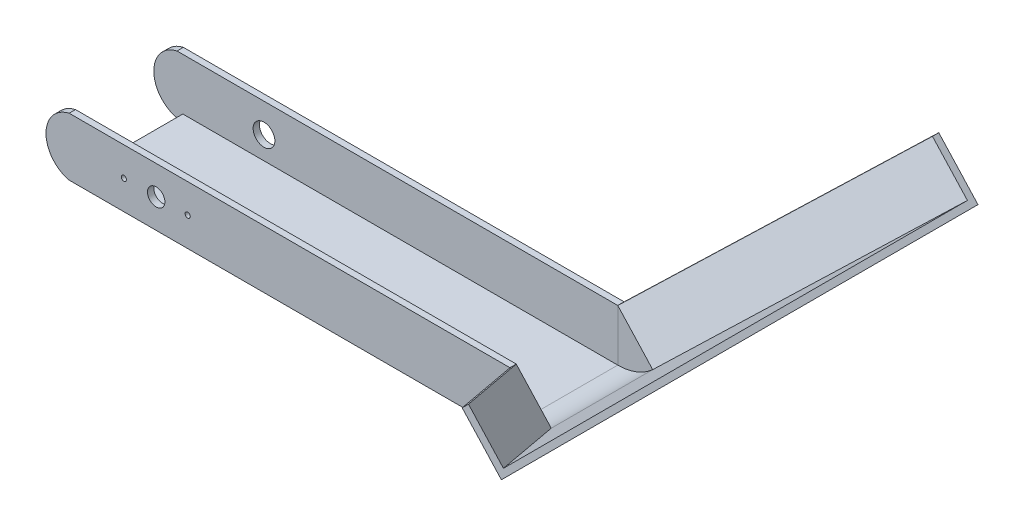
ISO-10303-21;
HEADER;
FILE_DESCRIPTION(('STEP AP214'),'2;1');
FILE_NAME('part.step','',(''),(''),'','','');
FILE_SCHEMA(('AUTOMOTIVE_DESIGN { 1 0 10303 214 1 1 1 1 }'));
ENDSEC;
DATA;
#1=APPLICATION_CONTEXT('core data for automotive mechanical design processes');
#2=APPLICATION_PROTOCOL_DEFINITION('international standard','automotive_design',2000,#1);
#3=PRODUCT_CONTEXT('',#1,'mechanical');
#4=PRODUCT('Part','Part','',(#3));
#5=PRODUCT_RELATED_PRODUCT_CATEGORY('part','',(#4));
#6=PRODUCT_DEFINITION_FORMATION('','',#4);
#7=PRODUCT_DEFINITION_CONTEXT('part definition',#1,'design');
#8=PRODUCT_DEFINITION('design','',#6,#7);
#9=PRODUCT_DEFINITION_SHAPE('','',#8);
#10=(LENGTH_UNIT() NAMED_UNIT(*) SI_UNIT(.MILLI.,.METRE.));
#11=(NAMED_UNIT(*) PLANE_ANGLE_UNIT() SI_UNIT($,.RADIAN.));
#12=(NAMED_UNIT(*) SI_UNIT($,.STERADIAN.) SOLID_ANGLE_UNIT());
#13=UNCERTAINTY_MEASURE_WITH_UNIT(LENGTH_MEASURE(1.E-05),#10,'distance_accuracy_value','');
#14=(GEOMETRIC_REPRESENTATION_CONTEXT(3) GLOBAL_UNCERTAINTY_ASSIGNED_CONTEXT((#13)) GLOBAL_UNIT_ASSIGNED_CONTEXT((#10,
#11,#12)) REPRESENTATION_CONTEXT('',''));
#15=CARTESIAN_POINT('',(0.,0.,0.));
#16=DIRECTION('',(0.,0.,1.));
#17=DIRECTION('',(1.,0.,0.));
#18=AXIS2_PLACEMENT_3D('',#15,#16,#17);
#19=CARTESIAN_POINT('',(-90.1530320109,-16.1412270673509,31.4271677660097));
#20=DIRECTION('',(0.,0.,-1.));
#21=DIRECTION('',(-1.,0.,0.));
#22=AXIS2_PLACEMENT_3D('',#19,#20,#21);
#23=PLANE('',#22);
#24=CARTESIAN_POINT('',(-41.1178794585354,-16.1412265646858,31.4271677660097));
#25=DIRECTION('',(0.,0.,1.));
#26=DIRECTION('',(1.,0.,0.));
#27=AXIS2_PLACEMENT_3D('',#24,#25,#26);
#28=CIRCLE('',#27,1.13029999999999);
#29=CARTESIAN_POINT('',(-39.9875794585354,-16.1412265646858,31.4271677660097));
#30=VERTEX_POINT('',#29);
#31=EDGE_CURVE('P0_E174',#30,#30,#28,.T.);
#32=ORIENTED_EDGE('',*,*,#31,.F.);
#33=EDGE_LOOP('',(#32));
#34=FACE_BOUND('',#33,.T.);
#35=CARTESIAN_POINT('',(-69.0781994585354,-16.1412265646858,31.4271677660097));
#36=DIRECTION('',(0.,0.,1.));
#37=DIRECTION('',(1.,0.,0.));
#38=AXIS2_PLACEMENT_3D('',#35,#36,#37);
#39=CIRCLE('',#38,1.13029999999999);
#40=CARTESIAN_POINT('',(-67.9478994585354,-16.1412265646858,31.4271677660097));
#41=VERTEX_POINT('',#40);
#42=EDGE_CURVE('P0_E168',#41,#41,#39,.T.);
#43=ORIENTED_EDGE('',*,*,#42,.F.);
#44=EDGE_LOOP('',(#43));
#45=FACE_BOUND('',#44,.T.);
#46=CARTESIAN_POINT('',(-90.1530320109,-16.1412270673509,31.4271677660097));
#47=DIRECTION('',(0.,0.,-1.));
#48=DIRECTION('',(-1.,0.,0.));
#49=AXIS2_PLACEMENT_3D('',#46,#47,#48);
#50=CIRCLE('',#49,13.0175001379264);
#51=CARTESIAN_POINT('',(-93.0105326392311,-28.8412270673509,31.4271677660097));
#52=VERTEX_POINT('',#51);
#53=CARTESIAN_POINT('',(-93.0105326392311,-3.44122706735089,31.4271677660097));
#54=VERTEX_POINT('',#53);
#55=EDGE_CURVE('P0_E86',#52,#54,#50,.T.);
#56=ORIENTED_EDGE('',*,*,#55,.F.);
#57=DIRECTION('',(-1.,0.,0.));
#58=VECTOR('',#57,1.);
#59=CARTESIAN_POINT('',(100.029467360769,-28.8412270673509,31.4271677660097));
#60=LINE('',#59,#58);
#61=CARTESIAN_POINT('',(100.029467360769,-28.8412270673509,31.4271677660097));
#62=VERTEX_POINT('',#61);
#63=EDGE_CURVE('P0_E71',#62,#52,#60,.T.);
#64=ORIENTED_EDGE('',*,*,#63,.F.);
#65=DIRECTION('',(0.,-1.,0.));
#66=VECTOR('',#65,1.);
#67=CARTESIAN_POINT('',(100.029467360769,-28.8412270673509,31.4271677660097));
#68=LINE('',#67,#66);
#69=CARTESIAN_POINT('',(100.029467360769,-3.44122706735089,31.4271677660097));
#70=VERTEX_POINT('',#69);
#71=EDGE_CURVE('P0_E59',#70,#62,#68,.T.);
#72=ORIENTED_EDGE('',*,*,#71,.F.);
#73=DIRECTION('',(-1.,0.,0.));
#74=VECTOR('',#73,1.);
#75=CARTESIAN_POINT('',(100.029467360769,-3.44122706735089,31.4271677660097));
#76=LINE('',#75,#74);
#77=EDGE_CURVE('P0_E81',#70,#54,#76,.T.);
#78=ORIENTED_EDGE('',*,*,#77,.T.);
#79=EDGE_LOOP('',(#56,#64,#72,#78));
#80=FACE_BOUND('',#79,.T.);
#81=CARTESIAN_POINT('',(-54.9105326392313,-16.1412265646858,31.4271677660097));
#82=DIRECTION('',(0.,0.,1.));
#83=DIRECTION('',(1.,0.,0.));
#84=AXIS2_PLACEMENT_3D('',#81,#82,#83);
#85=CIRCLE('',#84,3.81000000000001);
#86=CARTESIAN_POINT('',(-51.1005326392313,-16.1412265646858,31.4271677660097));
#87=VERTEX_POINT('',#86);
#88=EDGE_CURVE('P0_E177',#87,#87,#85,.T.);
#89=ORIENTED_EDGE('',*,*,#88,.F.);
#90=EDGE_LOOP('',(#89));
#91=FACE_BOUND('',#90,.T.);
#92=ADVANCED_FACE('P0_F33',(#34,#45,#80,#91),#23,.F.);
#93=CARTESIAN_POINT('',(0.,-26.0726270673509,0.));
#94=DIRECTION('',(0.,1.,0.));
#95=DIRECTION('',(0.,0.,1.));
#96=AXIS2_PLACEMENT_3D('',#93,#94,#95);
#97=PLANE('',#96);
#98=DIRECTION('',(-1.,0.,0.));
#99=VECTOR('',#98,1.);
#100=CARTESIAN_POINT('',(100.029467360769,-26.0726270673509,-15.7914322339903));
#101=LINE('',#100,#99);
#102=CARTESIAN_POINT('',(100.029467360769,-26.0726270673509,-15.7914322339903));
#103=VERTEX_POINT('',#102);
#104=CARTESIAN_POINT('',(-90.4705326392311,-26.0726270673509,-15.7914322339903));
#105=VERTEX_POINT('',#104);
#106=EDGE_CURVE('P0_E103',#103,#105,#101,.T.);
#107=ORIENTED_EDGE('',*,*,#106,.T.);
#108=DIRECTION('',(0.,0.,-1.));
#109=VECTOR('',#108,1.);
#110=CARTESIAN_POINT('',(-90.4705326392311,-26.0726270673509,28.6585677660097));
#111=LINE('',#110,#109);
#112=CARTESIAN_POINT('',(-90.4705326392311,-26.0726270673509,28.6585677660097));
#113=VERTEX_POINT('',#112);
#114=EDGE_CURVE('P0_E121',#113,#105,#111,.T.);
#115=ORIENTED_EDGE('',*,*,#114,.F.);
#116=DIRECTION('',(1.,0.,0.));
#117=VECTOR('',#116,1.);
#118=CARTESIAN_POINT('',(-93.0105326392311,-26.0726270673509,28.6585677660097));
#119=LINE('',#118,#117);
#120=CARTESIAN_POINT('',(100.029467360769,-26.0726270673509,28.6585677660097));
#121=VERTEX_POINT('',#120);
#122=EDGE_CURVE('P0_E107',#113,#121,#119,.T.);
#123=ORIENTED_EDGE('',*,*,#122,.T.);
#124=DIRECTION('',(0.,0.,-1.));
#125=VECTOR('',#124,1.);
#126=CARTESIAN_POINT('',(100.029467360769,-26.0726270673509,28.6585677660097));
#127=LINE('',#126,#125);
#128=EDGE_CURVE('P0_E111',#121,#103,#127,.T.);
#129=ORIENTED_EDGE('',*,*,#128,.T.);
#130=EDGE_LOOP('',(#107,#115,#123,#129));
#131=FACE_BOUND('',#130,.T.);
#132=ADVANCED_FACE('P0_F224',(#131),#97,.T.);
#133=CARTESIAN_POINT('',(-90.1530320109,-16.1412270673509,31.4271677660097));
#134=DIRECTION('',(0.,0.,-1.));
#135=DIRECTION('',(-1.,0.,0.));
#136=AXIS2_PLACEMENT_3D('',#133,#134,#135);
#137=CYLINDRICAL_SURFACE('',#136,13.0175001379264);
#138=CARTESIAN_POINT('',(-90.1530320109,-16.1412270673509,28.6585677660097));
#139=DIRECTION('',(0.,0.,-1.));
#140=DIRECTION('',(-1.,0.,0.));
#141=AXIS2_PLACEMENT_3D('',#138,#139,#140);
#142=CIRCLE('',#141,13.0175001379264);
#143=CARTESIAN_POINT('',(-93.0105326392311,-28.8412270673509,28.6585677660097));
#144=VERTEX_POINT('',#143);
#145=CARTESIAN_POINT('',(-93.0105326392311,-3.44122706735089,28.6585677660097));
#146=VERTEX_POINT('',#145);
#147=EDGE_CURVE('P0_E88',#144,#146,#142,.T.);
#148=ORIENTED_EDGE('',*,*,#147,.F.);
#149=DIRECTION('',(0.,0.,-1.));
#150=VECTOR('',#149,1.);
#151=CARTESIAN_POINT('',(-93.0105326392311,-28.8412270673509,31.4271677660097));
#152=LINE('',#151,#150);
#153=EDGE_CURVE('P0_E11',#52,#144,#152,.T.);
#154=ORIENTED_EDGE('',*,*,#153,.F.);
#155=ORIENTED_EDGE('',*,*,#55,.T.);
#156=DIRECTION('',(0.,0.,-1.));
#157=VECTOR('',#156,1.);
#158=CARTESIAN_POINT('',(-93.0105326392311,-3.44122706735089,31.4271677660097));
#159=LINE('',#158,#157);
#160=EDGE_CURVE('P0_E42',#54,#146,#159,.T.);
#161=ORIENTED_EDGE('',*,*,#160,.T.);
#162=EDGE_LOOP('',(#148,#154,#155,#161));
#163=FACE_BOUND('',#162,.T.);
#164=ADVANCED_FACE('P0_F35',(#163),#137,.T.);
#165=CARTESIAN_POINT('',(-90.1530320109,-16.1412270673509,28.6585677660097));
#166=DIRECTION('',(0.,0.,-1.));
#167=DIRECTION('',(-1.,0.,0.));
#168=AXIS2_PLACEMENT_3D('',#165,#166,#167);
#169=PLANE('',#168);
#170=CARTESIAN_POINT('',(-54.9105326392313,-16.1412265646858,28.6585677660097));
#171=DIRECTION('',(0.,0.,-1.));
#172=DIRECTION('',(-1.,0.,0.));
#173=AXIS2_PLACEMENT_3D('',#170,#171,#172);
#174=CIRCLE('',#173,3.81000000000001);
#175=CARTESIAN_POINT('',(-58.7205326392314,-16.1412265646858,28.6585677660097));
#176=VERTEX_POINT('',#175);
#177=EDGE_CURVE('P0_E37',#176,#176,#174,.T.);
#178=ORIENTED_EDGE('',*,*,#177,.F.);
#179=EDGE_LOOP('',(#178));
#180=FACE_BOUND('',#179,.T.);
#181=CARTESIAN_POINT('',(-41.1178794585354,-16.1412265646858,28.6585677660097));
#182=DIRECTION('',(0.,0.,-1.));
#183=DIRECTION('',(-1.,0.,0.));
#184=AXIS2_PLACEMENT_3D('',#181,#182,#183);
#185=CIRCLE('',#184,1.13029999999999);
#186=CARTESIAN_POINT('',(-42.2481794585354,-16.1412265646858,28.6585677660097));
#187=VERTEX_POINT('',#186);
#188=EDGE_CURVE('P0_E171',#187,#187,#185,.T.);
#189=ORIENTED_EDGE('',*,*,#188,.F.);
#190=EDGE_LOOP('',(#189));
#191=FACE_BOUND('',#190,.T.);
#192=CARTESIAN_POINT('',(-69.0781994585354,-16.1412265646858,28.6585677660097));
#193=DIRECTION('',(0.,0.,-1.));
#194=DIRECTION('',(-1.,0.,0.));
#195=AXIS2_PLACEMENT_3D('',#192,#193,#194);
#196=CIRCLE('',#195,1.13029999999999);
#197=CARTESIAN_POINT('',(-70.2084994585354,-16.1412265646858,28.6585677660097));
#198=VERTEX_POINT('',#197);
#199=EDGE_CURVE('P0_E165',#198,#198,#196,.T.);
#200=ORIENTED_EDGE('',*,*,#199,.F.);
#201=EDGE_LOOP('',(#200));
#202=FACE_BOUND('',#201,.T.);
#203=DIRECTION('',(-1.,0.,0.));
#204=VECTOR('',#203,1.);
#205=CARTESIAN_POINT('',(-90.4705326392311,-28.8412270673509,28.6585677660097));
#206=LINE('',#205,#204);
#207=CARTESIAN_POINT('',(-90.4705326392311,-28.8412270673509,28.6585677660097));
#208=VERTEX_POINT('',#207);
#209=EDGE_CURVE('P0_E108',#208,#144,#206,.T.);
#210=ORIENTED_EDGE('',*,*,#209,.T.);
#211=ORIENTED_EDGE('',*,*,#147,.T.);
#212=DIRECTION('',(1.,0.,0.));
#213=VECTOR('',#212,1.);
#214=CARTESIAN_POINT('',(-93.0105326392311,-3.44122706735089,28.6585677660097));
#215=LINE('',#214,#213);
#216=CARTESIAN_POINT('',(100.029467360769,-3.44122706735089,28.6585677660097));
#217=VERTEX_POINT('',#216);
#218=EDGE_CURVE('P0_E104',#146,#217,#215,.T.);
#219=ORIENTED_EDGE('',*,*,#218,.T.);
#220=DIRECTION('',(0.,1.,0.));
#221=VECTOR('',#220,1.);
#222=CARTESIAN_POINT('',(100.029467360769,-26.0726270673509,28.6585677660097));
#223=LINE('',#222,#221);
#224=EDGE_CURVE('P0_E100',#121,#217,#223,.T.);
#225=ORIENTED_EDGE('',*,*,#224,.F.);
#226=ORIENTED_EDGE('',*,*,#122,.F.);
#227=DIRECTION('',(0.,1.,0.));
#228=VECTOR('',#227,1.);
#229=CARTESIAN_POINT('',(-90.4705326392311,-28.8412270673509,28.6585677660097));
#230=LINE('',#229,#228);
#231=EDGE_CURVE('P0_E50',#208,#113,#230,.T.);
#232=ORIENTED_EDGE('',*,*,#231,.F.);
#233=EDGE_LOOP('',(#210,#211,#219,#225,#226,#232));
#234=FACE_BOUND('',#233,.T.);
#235=ADVANCED_FACE('P0_F186',(#180,#191,#202,#234),#169,.T.);
#236=CARTESIAN_POINT('',(100.029467360769,-3.44122706735089,31.4271677660097));
#237=DIRECTION('',(0.,-1.,0.));
#238=DIRECTION('',(0.,0.,-1.));
#239=AXIS2_PLACEMENT_3D('',#236,#237,#238);
#240=PLANE('',#239);
#241=DIRECTION('',(0.,0.,1.));
#242=VECTOR('',#241,1.);
#243=CARTESIAN_POINT('',(100.029467360769,-3.44122706735089,31.4271677660097));
#244=LINE('',#243,#242);
#245=EDGE_CURVE('P0_E98',#217,#70,#244,.T.);
#246=ORIENTED_EDGE('',*,*,#245,.F.);
#247=ORIENTED_EDGE('',*,*,#218,.F.);
#248=ORIENTED_EDGE('',*,*,#160,.F.);
#249=ORIENTED_EDGE('',*,*,#77,.F.);
#250=EDGE_LOOP('',(#246,#247,#248,#249));
#251=FACE_BOUND('',#250,.T.);
#252=ADVANCED_FACE('P0_F189',(#251),#240,.F.);
#253=CARTESIAN_POINT('',(100.029467360769,-28.8412270673509,-15.7914322339903));
#254=DIRECTION('',(0.,1.,0.));
#255=DIRECTION('',(0.,0.,1.));
#256=AXIS2_PLACEMENT_3D('',#253,#254,#255);
#257=PLANE('',#256);
#258=ORIENTED_EDGE('',*,*,#153,.T.);
#259=ORIENTED_EDGE('',*,*,#209,.F.);
#260=DIRECTION('',(0.,0.,1.));
#261=VECTOR('',#260,1.);
#262=CARTESIAN_POINT('',(-90.4705326392311,-28.8412270673509,-15.7914322339903));
#263=LINE('',#262,#261);
#264=CARTESIAN_POINT('',(-90.4705326392311,-28.8412270673509,-15.7914322339903));
#265=VERTEX_POINT('',#264);
#266=EDGE_CURVE('P0_E124',#265,#208,#263,.T.);
#267=ORIENTED_EDGE('',*,*,#266,.F.);
#268=DIRECTION('',(-1.,0.,0.));
#269=VECTOR('',#268,1.);
#270=CARTESIAN_POINT('',(-93.0105326392311,-28.8412270673509,-15.7914322339903));
#271=LINE('',#270,#269);
#272=CARTESIAN_POINT('',(-93.0105326392311,-28.8412270673509,-15.7914322339903));
#273=VERTEX_POINT('',#272);
#274=EDGE_CURVE('P0_E146',#265,#273,#271,.T.);
#275=ORIENTED_EDGE('',*,*,#274,.T.);
#276=DIRECTION('',(0.,0.,1.));
#277=VECTOR('',#276,1.);
#278=CARTESIAN_POINT('',(-93.0105326392311,-28.8412270673509,-18.5600322339903));
#279=LINE('',#278,#277);
#280=CARTESIAN_POINT('',(-93.0105326392311,-28.8412270673509,-18.5600322339903));
#281=VERTEX_POINT('',#280);
#282=EDGE_CURVE('P0_E126',#281,#273,#279,.T.);
#283=ORIENTED_EDGE('',*,*,#282,.F.);
#284=DIRECTION('',(-1.,0.,0.));
#285=VECTOR('',#284,1.);
#286=CARTESIAN_POINT('',(-93.0105326392311,-28.8412270673509,-18.5600322339903));
#287=LINE('',#286,#285);
#288=CARTESIAN_POINT('',(100.029467360769,-28.8412270673509,-18.5600322339903));
#289=VERTEX_POINT('',#288);
#290=EDGE_CURVE('P0_E139',#289,#281,#287,.T.);
#291=ORIENTED_EDGE('',*,*,#290,.F.);
#292=DIRECTION('',(0.,0.,-1.));
#293=VECTOR('',#292,1.);
#294=CARTESIAN_POINT('',(100.029467360769,-28.8412270673509,-15.7914322339903));
#295=LINE('',#294,#293);
#296=EDGE_CURVE('P0_E78',#62,#289,#295,.T.);
#297=ORIENTED_EDGE('',*,*,#296,.F.);
#298=ORIENTED_EDGE('',*,*,#63,.T.);
#299=EDGE_LOOP('',(#258,#259,#267,#275,#283,#291,#297,#298));
#300=FACE_BOUND('',#299,.T.);
#301=ADVANCED_FACE('P0_F73',(#300),#257,.F.);
#302=CARTESIAN_POINT('',(100.029467360769,0.,0.));
#303=DIRECTION('',(-1.,0.,0.));
#304=DIRECTION('',(0.,0.,1.));
#305=AXIS2_PLACEMENT_3D('',#302,#303,#304);
#306=PLANE('',#305);
#307=ORIENTED_EDGE('',*,*,#128,.F.);
#308=ORIENTED_EDGE('',*,*,#224,.T.);
#309=ORIENTED_EDGE('',*,*,#245,.T.);
#310=ORIENTED_EDGE('',*,*,#71,.T.);
#311=ORIENTED_EDGE('',*,*,#296,.T.);
#312=DIRECTION('',(0.,-1.,0.));
#313=VECTOR('',#312,1.);
#314=CARTESIAN_POINT('',(100.029467360769,-28.8412270673509,-18.5600322339903));
#315=LINE('',#314,#313);
#316=CARTESIAN_POINT('',(100.029467360769,-3.44122706735089,-18.5600322339903));
#317=VERTEX_POINT('',#316);
#318=EDGE_CURVE('P0_E135',#317,#289,#315,.T.);
#319=ORIENTED_EDGE('',*,*,#318,.F.);
#320=DIRECTION('',(0.,0.,1.));
#321=VECTOR('',#320,1.);
#322=CARTESIAN_POINT('',(100.029467360769,-3.44122706735089,-18.5600322339903));
#323=LINE('',#322,#321);
#324=CARTESIAN_POINT('',(100.029467360769,-3.44122706735089,-15.7914322339903));
#325=VERTEX_POINT('',#324);
#326=EDGE_CURVE('P0_E132',#317,#325,#323,.T.);
#327=ORIENTED_EDGE('',*,*,#326,.T.);
#328=DIRECTION('',(0.,-1.,0.));
#329=VECTOR('',#328,1.);
#330=CARTESIAN_POINT('',(100.029467360769,-28.8412270673509,-15.7914322339903));
#331=LINE('',#330,#329);
#332=EDGE_CURVE('P0_E136',#325,#103,#331,.T.);
#333=ORIENTED_EDGE('',*,*,#332,.T.);
#334=EDGE_LOOP('',(#307,#308,#309,#310,#311,#319,#327,#333));
#335=FACE_BOUND('',#334,.T.);
#336=ADVANCED_FACE('P0_F215',(#335),#306,.F.);
#337=CARTESIAN_POINT('',(-90.4705326392311,0.,0.));
#338=DIRECTION('',(-1.,0.,0.));
#339=DIRECTION('',(0.,0.,1.));
#340=AXIS2_PLACEMENT_3D('',#337,#338,#339);
#341=PLANE('',#340);
#342=ORIENTED_EDGE('',*,*,#266,.T.);
#343=ORIENTED_EDGE('',*,*,#231,.T.);
#344=ORIENTED_EDGE('',*,*,#114,.T.);
#345=DIRECTION('',(0.,-1.,0.));
#346=VECTOR('',#345,1.);
#347=CARTESIAN_POINT('',(-90.4705326392311,-26.0726270673509,-15.7914322339903));
#348=LINE('',#347,#346);
#349=EDGE_CURVE('P0_E118',#105,#265,#348,.T.);
#350=ORIENTED_EDGE('',*,*,#349,.T.);
#351=EDGE_LOOP('',(#342,#343,#344,#350));
#352=FACE_BOUND('',#351,.T.);
#353=ADVANCED_FACE('P0_F260',(#352),#341,.T.);
#354=CARTESIAN_POINT('',(-90.1530320109,-16.1412265646858,-15.7914322339903));
#355=DIRECTION('',(0.,0.,1.));
#356=DIRECTION('',(1.,0.,0.));
#357=AXIS2_PLACEMENT_3D('',#354,#355,#356);
#358=PLANE('',#357);
#359=CARTESIAN_POINT('',(-54.9105326392313,-16.1412265646858,-15.7914322339903));
#360=DIRECTION('',(0.,0.,1.));
#361=DIRECTION('',(1.,0.,0.));
#362=AXIS2_PLACEMENT_3D('',#359,#360,#361);
#363=CIRCLE('',#362,4.76249999999998);
#364=CARTESIAN_POINT('',(-50.1480326392314,-16.1412265646858,-15.7914322339903));
#365=VERTEX_POINT('',#364);
#366=EDGE_CURVE('P0_E162',#365,#365,#363,.T.);
#367=ORIENTED_EDGE('',*,*,#366,.F.);
#368=EDGE_LOOP('',(#367));
#369=FACE_BOUND('',#368,.T.);
#370=ORIENTED_EDGE('',*,*,#349,.F.);
#371=ORIENTED_EDGE('',*,*,#106,.F.);
#372=ORIENTED_EDGE('',*,*,#332,.F.);
#373=DIRECTION('',(1.,0.,0.));
#374=VECTOR('',#373,1.);
#375=CARTESIAN_POINT('',(100.029467360769,-3.44122706735089,-15.7914322339903));
#376=LINE('',#375,#374);
#377=CARTESIAN_POINT('',(-93.0105371073609,-3.44122706735089,-15.7914322339903));
#378=VERTEX_POINT('',#377);
#379=EDGE_CURVE('P0_E140',#378,#325,#376,.T.);
#380=ORIENTED_EDGE('',*,*,#379,.F.);
#381=CARTESIAN_POINT('',(-90.1530320109,-16.1412265646858,-15.7914322339903));
#382=DIRECTION('',(0.,0.,-1.));
#383=DIRECTION('',(1.,0.,0.));
#384=AXIS2_PLACEMENT_3D('',#381,#382,#383);
#385=CIRCLE('',#384,13.0175006283313);
#386=EDGE_CURVE('P0_E143',#273,#378,#385,.T.);
#387=ORIENTED_EDGE('',*,*,#386,.F.);
#388=ORIENTED_EDGE('',*,*,#274,.F.);
#389=EDGE_LOOP('',(#370,#371,#372,#380,#387,#388));
#390=FACE_BOUND('',#389,.T.);
#391=ADVANCED_FACE('P0_F256',(#369,#390),#358,.T.);
#392=CARTESIAN_POINT('',(-90.1530320109,-16.1412265646858,-18.5600322339903));
#393=DIRECTION('',(0.,0.,1.));
#394=DIRECTION('',(1.,0.,0.));
#395=AXIS2_PLACEMENT_3D('',#392,#393,#394);
#396=CYLINDRICAL_SURFACE('',#395,13.0175006283313);
#397=ORIENTED_EDGE('',*,*,#386,.T.);
#398=DIRECTION('',(0.,0.,1.));
#399=VECTOR('',#398,1.);
#400=CARTESIAN_POINT('',(-93.0105371073609,-3.44122706735089,-18.5600322339903));
#401=LINE('',#400,#399);
#402=CARTESIAN_POINT('',(-93.0105371073609,-3.44122706735089,-18.5600322339903));
#403=VERTEX_POINT('',#402);
#404=EDGE_CURVE('P0_E129',#403,#378,#401,.T.);
#405=ORIENTED_EDGE('',*,*,#404,.F.);
#406=CARTESIAN_POINT('',(-90.1530320109,-16.1412265646858,-18.5600322339903));
#407=DIRECTION('',(0.,0.,-1.));
#408=DIRECTION('',(1.,0.,0.));
#409=AXIS2_PLACEMENT_3D('',#406,#407,#408);
#410=CIRCLE('',#409,13.0175006283313);
#411=EDGE_CURVE('P0_E155',#281,#403,#410,.T.);
#412=ORIENTED_EDGE('',*,*,#411,.F.);
#413=ORIENTED_EDGE('',*,*,#282,.T.);
#414=EDGE_LOOP('',(#397,#405,#412,#413));
#415=FACE_BOUND('',#414,.T.);
#416=ADVANCED_FACE('P0_F259',(#415),#396,.T.);
#417=CARTESIAN_POINT('',(100.029467360769,-3.44122706735089,-18.5600322339903));
#418=DIRECTION('',(0.,-1.,0.));
#419=DIRECTION('',(0.,0.,-1.));
#420=AXIS2_PLACEMENT_3D('',#417,#418,#419);
#421=PLANE('',#420);
#422=ORIENTED_EDGE('',*,*,#379,.T.);
#423=ORIENTED_EDGE('',*,*,#326,.F.);
#424=DIRECTION('',(1.,0.,0.));
#425=VECTOR('',#424,1.);
#426=CARTESIAN_POINT('',(100.029467360769,-3.44122706735089,-18.5600322339903));
#427=LINE('',#426,#425);
#428=EDGE_CURVE('P0_E152',#403,#317,#427,.T.);
#429=ORIENTED_EDGE('',*,*,#428,.F.);
#430=ORIENTED_EDGE('',*,*,#404,.T.);
#431=EDGE_LOOP('',(#422,#423,#429,#430));
#432=FACE_BOUND('',#431,.T.);
#433=ADVANCED_FACE('P0_F254',(#432),#421,.F.);
#434=CARTESIAN_POINT('',(-90.1530320109,-16.1412265646858,-18.5600322339903));
#435=DIRECTION('',(0.,0.,1.));
#436=DIRECTION('',(1.,0.,0.));
#437=AXIS2_PLACEMENT_3D('',#434,#435,#436);
#438=PLANE('',#437);
#439=CARTESIAN_POINT('',(-54.9105326392313,-16.1412265646858,-18.5600322339903));
#440=DIRECTION('',(0.,0.,1.));
#441=DIRECTION('',(1.,0.,0.));
#442=AXIS2_PLACEMENT_3D('',#439,#440,#441);
#443=CIRCLE('',#442,4.76249999999998);
#444=CARTESIAN_POINT('',(-50.1480326392314,-16.1412265646858,-18.5600322339903));
#445=VERTEX_POINT('',#444);
#446=EDGE_CURVE('P0_E149',#445,#445,#443,.T.);
#447=ORIENTED_EDGE('',*,*,#446,.T.);
#448=EDGE_LOOP('',(#447));
#449=FACE_BOUND('',#448,.T.);
#450=ORIENTED_EDGE('',*,*,#290,.T.);
#451=ORIENTED_EDGE('',*,*,#411,.T.);
#452=ORIENTED_EDGE('',*,*,#428,.T.);
#453=ORIENTED_EDGE('',*,*,#318,.T.);
#454=EDGE_LOOP('',(#450,#451,#452,#453));
#455=FACE_BOUND('',#454,.T.);
#456=ADVANCED_FACE('P0_F247',(#449,#455),#438,.F.);
#457=CARTESIAN_POINT('',(-54.9105326392313,-16.1412265646858,-15.7914322339903));
#458=DIRECTION('',(0.,0.,1.));
#459=DIRECTION('',(1.,0.,0.));
#460=AXIS2_PLACEMENT_3D('',#457,#458,#459);
#461=CYLINDRICAL_SURFACE('',#460,4.76249999999998);
#462=ORIENTED_EDGE('',*,*,#446,.F.);
#463=EDGE_LOOP('',(#462));
#464=FACE_BOUND('',#463,.T.);
#465=ORIENTED_EDGE('',*,*,#366,.T.);
#466=EDGE_LOOP('',(#465));
#467=FACE_BOUND('',#466,.T.);
#468=ADVANCED_FACE('P0_F239',(#464,#467),#461,.F.);
#469=CARTESIAN_POINT('',(-69.0781994585354,-16.1412265646858,31.4271677660097));
#470=DIRECTION('',(0.,0.,1.));
#471=DIRECTION('',(1.,0.,0.));
#472=AXIS2_PLACEMENT_3D('',#469,#470,#471);
#473=CYLINDRICAL_SURFACE('',#472,1.13029999999999);
#474=ORIENTED_EDGE('',*,*,#42,.T.);
#475=EDGE_LOOP('',(#474));
#476=FACE_BOUND('',#475,.T.);
#477=ORIENTED_EDGE('',*,*,#199,.T.);
#478=EDGE_LOOP('',(#477));
#479=FACE_BOUND('',#478,.T.);
#480=ADVANCED_FACE('P0_F235',(#476,#479),#473,.F.);
#481=CARTESIAN_POINT('',(-41.1178794585354,-16.1412265646858,31.4271677660097));
#482=DIRECTION('',(0.,0.,1.));
#483=DIRECTION('',(1.,0.,0.));
#484=AXIS2_PLACEMENT_3D('',#481,#482,#483);
#485=CYLINDRICAL_SURFACE('',#484,1.13029999999999);
#486=ORIENTED_EDGE('',*,*,#31,.T.);
#487=EDGE_LOOP('',(#486));
#488=FACE_BOUND('',#487,.T.);
#489=ORIENTED_EDGE('',*,*,#188,.T.);
#490=EDGE_LOOP('',(#489));
#491=FACE_BOUND('',#490,.T.);
#492=ADVANCED_FACE('P0_F238',(#488,#491),#485,.F.);
#493=CARTESIAN_POINT('',(-54.9105326392313,-16.1412265646858,31.4271677660097));
#494=DIRECTION('',(0.,0.,1.));
#495=DIRECTION('',(1.,0.,0.));
#496=AXIS2_PLACEMENT_3D('',#493,#494,#495);
#497=CYLINDRICAL_SURFACE('',#496,3.81000000000001);
#498=ORIENTED_EDGE('',*,*,#177,.T.);
#499=EDGE_LOOP('',(#498));
#500=FACE_BOUND('',#499,.T.);
#501=ORIENTED_EDGE('',*,*,#88,.T.);
#502=EDGE_LOOP('',(#501));
#503=FACE_BOUND('',#502,.T.);
#504=ADVANCED_FACE('P0_F184',(#500,#503),#497,.F.);
#505=CLOSED_SHELL('',(#92,#132,#164,#235,#252,#301,#336,#353,#391,#416,#433,#456,#468,#480,#492,#504));
#506=MANIFOLD_SOLID_BREP('P0_B2',#505);
#507=CARTESIAN_POINT('',(81.3265376483104,-20.648913669209,-15.7914322339902));
#508=DIRECTION('',(0.,0.,-1.));
#509=DIRECTION('',(-0.736335815451119,-0.676616262651095,0.));
#510=AXIS2_PLACEMENT_3D('',#507,#508,#509);
#511=PLANE('',#510);
#512=CARTESIAN_POINT('',(100.08480915517,-3.5230869736741,-15.7914322339902));
#513=DIRECTION('',(0.,0.,-1.));
#514=DIRECTION('',(-0.736335815451119,-0.676616262651095,0.));
#515=AXIS2_PLACEMENT_3D('',#512,#513,#514);
#516=CIRCLE('',#515,22.5496080043655);
#517=CARTESIAN_POINT('',(115.342240647331,-20.1271709716716,-15.7914322339902));
#518=VERTEX_POINT('',#517);
#519=CARTESIAN_POINT('',(100.029467360769,-26.0726270673509,-15.7914322339902));
#520=VERTEX_POINT('',#519);
#521=EDGE_CURVE('P1_E128',#518,#520,#516,.T.);
#522=ORIENTED_EDGE('',*,*,#521,.F.);
#523=DIRECTION('',(0.676616262651095,-0.736335815451119,0.));
#524=VECTOR('',#523,1.);
#525=CARTESIAN_POINT('',(100.029467360769,-3.46286059787116,-15.7914322339902));
#526=LINE('',#525,#524);
#527=CARTESIAN_POINT('',(100.029467360769,-3.46286059787116,-15.7914322339902));
#528=VERTEX_POINT('',#527);
#529=EDGE_CURVE('P1_E244',#528,#518,#526,.T.);
#530=ORIENTED_EDGE('',*,*,#529,.F.);
#531=DIRECTION('',(0.,1.,0.));
#532=VECTOR('',#531,1.);
#533=CARTESIAN_POINT('',(100.029467360769,-3.46286059787116,-15.7914322339902));
#534=LINE('',#533,#532);
#535=EDGE_CURVE('P1_E215',#520,#528,#534,.T.);
#536=ORIENTED_EDGE('',*,*,#535,.F.);
#537=EDGE_LOOP('',(#522,#530,#536));
#538=FACE_BOUND('',#537,.T.);
#539=ADVANCED_FACE('P1_F19',(#538),#511,.F.);
#540=CARTESIAN_POINT('',(100.029467360769,-3.46286059787116,28.6585677660098));
#541=DIRECTION('',(-0.520668048336013,-0.478439947581688,0.707106781186546));
#542=DIRECTION('',(0.520668048336012,0.478439947581687,0.707106781186549));
#543=AXIS2_PLACEMENT_3D('',#540,#541,#542);
#544=PLANE('',#543);
#545=DIRECTION('',(0.676616262651095,-0.736335815451119,0.));
#546=VECTOR('',#545,1.);
#547=CARTESIAN_POINT('',(158.476122712201,50.2435552500595,108.03356776601));
#548=LINE('',#547,#546);
#549=CARTESIAN_POINT('',(158.476122712201,50.2435552500595,108.03356776601));
#550=VERTEX_POINT('',#549);
#551=CARTESIAN_POINT('',(173.788895998763,33.5792448762591,108.03356776601));
#552=VERTEX_POINT('',#551);
#553=EDGE_CURVE('P1_E35',#550,#552,#548,.T.);
#554=ORIENTED_EDGE('',*,*,#553,.T.);
#555=DIRECTION('',(0.520668048336012,0.478439947581687,0.707106781186549));
#556=VECTOR('',#555,1.);
#557=CARTESIAN_POINT('',(115.342240647331,-20.1271709716716,28.6585677660098));
#558=LINE('',#557,#556);
#559=CARTESIAN_POINT('',(115.342240647331,-20.1271709716716,28.6585677660097));
#560=VERTEX_POINT('',#559);
#561=EDGE_CURVE('P1_E203',#560,#552,#558,.T.);
#562=ORIENTED_EDGE('',*,*,#561,.F.);
#563=DIRECTION('',(0.676616262651095,-0.736335815451119,0.));
#564=VECTOR('',#563,1.);
#565=CARTESIAN_POINT('',(100.029467360769,-3.46286059787116,28.6585677660098));
#566=LINE('',#565,#564);
#567=CARTESIAN_POINT('',(100.029467360769,-3.46286059787116,28.6585677660098));
#568=VERTEX_POINT('',#567);
#569=EDGE_CURVE('P1_E11',#568,#560,#566,.T.);
#570=ORIENTED_EDGE('',*,*,#569,.F.);
#571=DIRECTION('',(-0.520668048336012,-0.478439947581687,-0.707106781186549));
#572=VECTOR('',#571,1.);
#573=CARTESIAN_POINT('',(100.029467360769,-3.46286059787116,28.6585677660098));
#574=LINE('',#573,#572);
#575=EDGE_CURVE('P1_E63',#550,#568,#574,.T.);
#576=ORIENTED_EDGE('',*,*,#575,.F.);
#577=EDGE_LOOP('',(#554,#562,#570,#576));
#578=FACE_BOUND('',#577,.T.);
#579=ADVANCED_FACE('P1_F21',(#578),#544,.F.);
#580=CARTESIAN_POINT('',(99.0101576914399,-4.39950049025907,30.0428677660098));
#581=DIRECTION('',(0.520668048336013,0.478439947581688,-0.707106781186547));
#582=DIRECTION('',(-0.520668048336012,-0.478439947581687,-0.707106781186548));
#583=AXIS2_PLACEMENT_3D('',#580,#581,#582);
#584=PLANE('',#583);
#585=DIRECTION('',(0.520668048336012,0.478439947581687,0.707106781186548));
#586=VECTOR('',#585,1.);
#587=CARTESIAN_POINT('',(116.196210762778,-23.1024302027175,30.0428677660098));
#588=LINE('',#587,#586);
#589=CARTESIAN_POINT('',(117.215520432107,-22.1657903103296,31.4271677660098));
#590=VERTEX_POINT('',#589);
#591=CARTESIAN_POINT('',(175.662175783539,31.5406255376011,110.80216776601));
#592=VERTEX_POINT('',#591);
#593=EDGE_CURVE('P1_E59',#590,#592,#588,.T.);
#594=ORIENTED_EDGE('',*,*,#593,.T.);
#595=DIRECTION('',(0.676616262651095,-0.736335815451119,0.));
#596=VECTOR('',#595,1.);
#597=CARTESIAN_POINT('',(158.476122712201,50.2435552500595,110.80216776601));
#598=LINE('',#597,#596);
#599=CARTESIAN_POINT('',(158.476122712201,50.2435552500595,110.80216776601));
#600=VERTEX_POINT('',#599);
#601=EDGE_CURVE('P1_E156',#600,#592,#598,.T.);
#602=ORIENTED_EDGE('',*,*,#601,.F.);
#603=DIRECTION('',(0.520668048336012,0.478439947581687,0.707106781186548));
#604=VECTOR('',#603,1.);
#605=CARTESIAN_POINT('',(99.0101576914399,-4.39950049025907,30.0428677660098));
#606=LINE('',#605,#604);
#607=CARTESIAN_POINT('',(100.029467360769,-3.46286059787116,31.4271677660098));
#608=VERTEX_POINT('',#607);
#609=EDGE_CURVE('P1_E163',#608,#600,#606,.T.);
#610=ORIENTED_EDGE('',*,*,#609,.F.);
#611=DIRECTION('',(0.676616262651095,-0.736335815451119,0.));
#612=VECTOR('',#611,1.);
#613=CARTESIAN_POINT('',(100.029467360769,-3.46286059787116,31.4271677660098));
#614=LINE('',#613,#612);
#615=EDGE_CURVE('P1_E28',#608,#590,#614,.T.);
#616=ORIENTED_EDGE('',*,*,#615,.T.);
#617=EDGE_LOOP('',(#594,#602,#610,#616));
#618=FACE_BOUND('',#617,.T.);
#619=ADVANCED_FACE('P1_F162',(#618),#584,.F.);
#620=CARTESIAN_POINT('',(158.476122712201,50.2435552500595,28.6585677660098));
#621=DIRECTION('',(-0.736335815451119,-0.676616262651095,0.));
#622=DIRECTION('',(0.,0.,1.));
#623=AXIS2_PLACEMENT_3D('',#620,#621,#622);
#624=PLANE('',#623);
#625=DIRECTION('',(0.,0.,-1.));
#626=VECTOR('',#625,1.);
#627=CARTESIAN_POINT('',(175.662175783539,31.5406255376011,28.6585677660098));
#628=LINE('',#627,#626);
#629=CARTESIAN_POINT('',(175.662175783539,31.5406255376011,-97.93503223399));
#630=VERTEX_POINT('',#629);
#631=EDGE_CURVE('P1_E157',#592,#630,#628,.T.);
#632=ORIENTED_EDGE('',*,*,#631,.T.);
#633=DIRECTION('',(0.676616262651095,-0.736335815451119,0.));
#634=VECTOR('',#633,1.);
#635=CARTESIAN_POINT('',(158.476122712201,50.2435552500596,-97.93503223399));
#636=LINE('',#635,#634);
#637=CARTESIAN_POINT('',(158.476122712201,50.2435552500596,-97.93503223399));
#638=VERTEX_POINT('',#637);
#639=EDGE_CURVE('P1_E256',#638,#630,#636,.T.);
#640=ORIENTED_EDGE('',*,*,#639,.F.);
#641=DIRECTION('',(0.,0.,-1.));
#642=VECTOR('',#641,1.);
#643=CARTESIAN_POINT('',(158.476122712201,50.2435552500595,28.6585677660098));
#644=LINE('',#643,#642);
#645=CARTESIAN_POINT('',(158.476122712201,50.2435552500595,-95.16643223399));
#646=VERTEX_POINT('',#645);
#647=EDGE_CURVE('P1_E234',#646,#638,#644,.T.);
#648=ORIENTED_EDGE('',*,*,#647,.F.);
#649=DIRECTION('',(0.676616262651095,-0.736335815451119,0.));
#650=VECTOR('',#649,1.);
#651=CARTESIAN_POINT('',(158.476122712201,50.2435552500595,-95.16643223399));
#652=LINE('',#651,#650);
#653=CARTESIAN_POINT('',(173.788895998763,33.5792448762591,-95.16643223399));
#654=VERTEX_POINT('',#653);
#655=EDGE_CURVE('P1_E260',#646,#654,#652,.T.);
#656=ORIENTED_EDGE('',*,*,#655,.T.);
#657=DIRECTION('',(0.,0.,-1.));
#658=VECTOR('',#657,1.);
#659=CARTESIAN_POINT('',(173.788895998763,33.5792448762591,108.03356776601));
#660=LINE('',#659,#658);
#661=EDGE_CURVE('P1_E200',#552,#654,#660,.T.);
#662=ORIENTED_EDGE('',*,*,#661,.F.);
#663=ORIENTED_EDGE('',*,*,#553,.F.);
#664=DIRECTION('',(0.,0.,-1.));
#665=VECTOR('',#664,1.);
#666=CARTESIAN_POINT('',(158.476122712201,50.2435552500595,28.6585677660098));
#667=LINE('',#666,#665);
#668=EDGE_CURVE('P1_E44',#600,#550,#667,.T.);
#669=ORIENTED_EDGE('',*,*,#668,.F.);
#670=ORIENTED_EDGE('',*,*,#601,.T.);
#671=EDGE_LOOP('',(#632,#640,#648,#656,#662,#663,#669,#670));
#672=FACE_BOUND('',#671,.T.);
#673=ADVANCED_FACE('P1_F198',(#672),#624,.F.);
#674=CARTESIAN_POINT('',(100.029467360769,-3.46286059787116,28.6585677660098));
#675=DIRECTION('',(-0.676616262651095,0.736335815451119,0.));
#676=DIRECTION('',(0.736335815451119,0.676616262651095,0.));
#677=AXIS2_PLACEMENT_3D('',#674,#675,#676);
#678=PLANE('',#677);
#679=ORIENTED_EDGE('',*,*,#575,.T.);
#680=DIRECTION('',(0.,0.,1.));
#681=VECTOR('',#680,1.);
#682=CARTESIAN_POINT('',(100.029467360769,-3.46286059787116,28.6585677660098));
#683=LINE('',#682,#681);
#684=EDGE_CURVE('P1_E186',#568,#608,#683,.T.);
#685=ORIENTED_EDGE('',*,*,#684,.T.);
#686=ORIENTED_EDGE('',*,*,#609,.T.);
#687=ORIENTED_EDGE('',*,*,#668,.T.);
#688=EDGE_LOOP('',(#679,#685,#686,#687));
#689=FACE_BOUND('',#688,.T.);
#690=ADVANCED_FACE('P1_F196',(#689),#678,.T.);
#691=CARTESIAN_POINT('',(117.215520432107,-22.1657903103296,28.6585677660098));
#692=DIRECTION('',(-0.676616262651095,0.736335815451119,0.));
#693=DIRECTION('',(0.736335815451119,0.676616262651095,0.));
#694=AXIS2_PLACEMENT_3D('',#691,#692,#693);
#695=PLANE('',#694);
#696=DIRECTION('',(0.,0.,1.));
#697=VECTOR('',#696,1.);
#698=CARTESIAN_POINT('',(117.215520432107,-22.1657903103296,28.6585677660098));
#699=LINE('',#698,#697);
#700=CARTESIAN_POINT('',(117.215520432107,-22.1657903103296,-18.5600322339902));
#701=VERTEX_POINT('',#700);
#702=EDGE_CURVE('P1_E125',#701,#590,#699,.T.);
#703=ORIENTED_EDGE('',*,*,#702,.F.);
#704=DIRECTION('',(-0.520668048336013,-0.478439947581688,0.707106781186546));
#705=VECTOR('',#704,1.);
#706=CARTESIAN_POINT('',(99.8311472643766,-38.1402266401381,5.0492677660097));
#707=LINE('',#706,#705);
#708=EDGE_CURVE('P1_E217',#630,#701,#707,.T.);
#709=ORIENTED_EDGE('',*,*,#708,.F.);
#710=ORIENTED_EDGE('',*,*,#631,.F.);
#711=ORIENTED_EDGE('',*,*,#593,.F.);
#712=EDGE_LOOP('',(#703,#709,#710,#711));
#713=FACE_BOUND('',#712,.T.);
#714=ADVANCED_FACE('P1_F166',(#713),#695,.F.);
#715=CARTESIAN_POINT('',(115.342240647331,-20.1271709716716,28.6585677660098));
#716=DIRECTION('',(-0.676616262651095,0.736335815451119,0.));
#717=DIRECTION('',(0.736335815451119,0.676616262651095,0.));
#718=AXIS2_PLACEMENT_3D('',#715,#716,#717);
#719=PLANE('',#718);
#720=ORIENTED_EDGE('',*,*,#561,.T.);
#721=ORIENTED_EDGE('',*,*,#661,.T.);
#722=DIRECTION('',(-0.520668048336013,-0.478439947581688,0.707106781186546));
#723=VECTOR('',#722,1.);
#724=CARTESIAN_POINT('',(115.342240647331,-20.1271709716716,-15.7914322339902));
#725=LINE('',#724,#723);
#726=EDGE_CURVE('P1_E271',#654,#518,#725,.T.);
#727=ORIENTED_EDGE('',*,*,#726,.T.);
#728=DIRECTION('',(0.,0.,1.));
#729=VECTOR('',#728,1.);
#730=CARTESIAN_POINT('',(115.342240647331,-20.1271709716716,28.6585677660098));
#731=LINE('',#730,#729);
#732=EDGE_CURVE('P1_E171',#518,#560,#731,.T.);
#733=ORIENTED_EDGE('',*,*,#732,.T.);
#734=EDGE_LOOP('',(#720,#721,#727,#733));
#735=FACE_BOUND('',#734,.T.);
#736=ADVANCED_FACE('P1_F278',(#735),#719,.T.);
#737=CARTESIAN_POINT('',(83.6644038623677,-18.5006570352918,6.43356776600971));
#738=DIRECTION('',(-0.520668048336011,-0.478439947581687,-0.707106781186549));
#739=DIRECTION('',(-0.520668048336013,-0.478439947581688,0.707106781186546));
#740=AXIS2_PLACEMENT_3D('',#737,#738,#739);
#741=PLANE('',#740);
#742=ORIENTED_EDGE('',*,*,#726,.F.);
#743=ORIENTED_EDGE('',*,*,#655,.F.);
#744=DIRECTION('',(0.520668048336013,0.478439947581688,-0.707106781186546));
#745=VECTOR('',#744,1.);
#746=CARTESIAN_POINT('',(83.6644038623677,-18.5006570352918,6.43356776600971));
#747=LINE('',#746,#745);
#748=EDGE_CURVE('P1_E229',#528,#646,#747,.T.);
#749=ORIENTED_EDGE('',*,*,#748,.F.);
#750=ORIENTED_EDGE('',*,*,#529,.T.);
#751=EDGE_LOOP('',(#742,#743,#749,#750));
#752=FACE_BOUND('',#751,.T.);
#753=ADVANCED_FACE('P1_F296',(#752),#741,.F.);
#754=CARTESIAN_POINT('',(82.6450941930387,-19.4372969276797,5.0492677660097));
#755=DIRECTION('',(0.520668048336011,0.478439947581687,0.707106781186549));
#756=DIRECTION('',(0.520668048336013,0.478439947581688,-0.707106781186546));
#757=AXIS2_PLACEMENT_3D('',#754,#755,#756);
#758=PLANE('',#757);
#759=ORIENTED_EDGE('',*,*,#708,.T.);
#760=DIRECTION('',(0.676616262651095,-0.736335815451119,0.));
#761=VECTOR('',#760,1.);
#762=CARTESIAN_POINT('',(100.029467360769,-3.46286059787116,-18.5600322339902));
#763=LINE('',#762,#761);
#764=CARTESIAN_POINT('',(100.029467360769,-3.46286059787116,-18.5600322339902));
#765=VERTEX_POINT('',#764);
#766=EDGE_CURVE('P1_E252',#765,#701,#763,.T.);
#767=ORIENTED_EDGE('',*,*,#766,.F.);
#768=DIRECTION('',(-0.520668048336013,-0.478439947581688,0.707106781186546));
#769=VECTOR('',#768,1.);
#770=CARTESIAN_POINT('',(82.6450941930387,-19.4372969276797,5.0492677660097));
#771=LINE('',#770,#769);
#772=EDGE_CURVE('P1_E240',#638,#765,#771,.T.);
#773=ORIENTED_EDGE('',*,*,#772,.F.);
#774=ORIENTED_EDGE('',*,*,#639,.T.);
#775=EDGE_LOOP('',(#759,#767,#773,#774));
#776=FACE_BOUND('',#775,.T.);
#777=ADVANCED_FACE('P1_F299',(#776),#758,.F.);
#778=CARTESIAN_POINT('',(100.029467360769,-3.46286059787116,28.6585677660098));
#779=DIRECTION('',(-0.676616262651095,0.736335815451119,0.));
#780=DIRECTION('',(0.736335815451119,0.676616262651095,0.));
#781=AXIS2_PLACEMENT_3D('',#778,#779,#780);
#782=PLANE('',#781);
#783=DIRECTION('',(0.,0.,-1.));
#784=VECTOR('',#783,1.);
#785=CARTESIAN_POINT('',(100.029467360769,-3.46286059787116,20.1295922502864));
#786=LINE('',#785,#784);
#787=EDGE_CURVE('P1_E119',#528,#765,#786,.T.);
#788=ORIENTED_EDGE('',*,*,#787,.F.);
#789=ORIENTED_EDGE('',*,*,#748,.T.);
#790=ORIENTED_EDGE('',*,*,#647,.T.);
#791=ORIENTED_EDGE('',*,*,#772,.T.);
#792=EDGE_LOOP('',(#788,#789,#790,#791));
#793=FACE_BOUND('',#792,.T.);
#794=ADVANCED_FACE('P1_F288',(#793),#782,.T.);
#795=CARTESIAN_POINT('',(98.5125907196482,-39.3518433816674,-18.5600322339902));
#796=DIRECTION('',(0.,0.,1.));
#797=DIRECTION('',(0.736335815451119,0.676616262651095,0.));
#798=AXIS2_PLACEMENT_3D('',#795,#796,#797);
#799=PLANE('',#798);
#800=DIRECTION('',(0.93175575910647,0.363085672220655,0.));
#801=VECTOR('',#800,1.);
#802=CARTESIAN_POINT('',(100.029467360769,-28.8628346497287,-18.5600322339902));
#803=LINE('',#802,#801);
#804=CARTESIAN_POINT('',(100.029467360769,-28.8628346497287,-18.5600322339902));
#805=VERTEX_POINT('',#804);
#806=EDGE_CURVE('P1_E120',#805,#701,#803,.T.);
#807=ORIENTED_EDGE('',*,*,#806,.F.);
#808=DIRECTION('',(0.,-1.,0.));
#809=VECTOR('',#808,1.);
#810=CARTESIAN_POINT('',(100.029467360769,-3.46286059787116,-18.5600322339902));
#811=LINE('',#810,#809);
#812=EDGE_CURVE('P1_E114',#765,#805,#811,.T.);
#813=ORIENTED_EDGE('',*,*,#812,.F.);
#814=ORIENTED_EDGE('',*,*,#766,.T.);
#815=EDGE_LOOP('',(#807,#813,#814));
#816=FACE_BOUND('',#815,.T.);
#817=ADVANCED_FACE('P1_F301',(#816),#799,.F.);
#818=CARTESIAN_POINT('',(100.029467360769,-3.46286059787116,20.1295922502864));
#819=DIRECTION('',(1.,0.,0.));
#820=DIRECTION('',(0.,-1.,0.));
#821=AXIS2_PLACEMENT_3D('',#818,#819,#820);
#822=PLANE('',#821);
#823=DIRECTION('',(0.,0.,-1.));
#824=VECTOR('',#823,1.);
#825=CARTESIAN_POINT('',(100.029467360769,-28.8628346497287,20.1295922502864));
#826=LINE('',#825,#824);
#827=CARTESIAN_POINT('',(100.029467360769,-28.8628346497287,31.4271677660097));
#828=VERTEX_POINT('',#827);
#829=EDGE_CURVE('P1_E106',#828,#805,#826,.T.);
#830=ORIENTED_EDGE('',*,*,#829,.F.);
#831=DIRECTION('',(0.,-1.,0.));
#832=VECTOR('',#831,1.);
#833=CARTESIAN_POINT('',(100.029467360769,-3.46286059787116,31.4271677660097));
#834=LINE('',#833,#832);
#835=EDGE_CURVE('P1_E111',#608,#828,#834,.T.);
#836=ORIENTED_EDGE('',*,*,#835,.F.);
#837=ORIENTED_EDGE('',*,*,#684,.F.);
#838=DIRECTION('',(0.,-1.,0.));
#839=VECTOR('',#838,1.);
#840=CARTESIAN_POINT('',(100.029467360769,-3.46286059787116,28.6585677660098));
#841=LINE('',#840,#839);
#842=CARTESIAN_POINT('',(100.029467360769,-26.0726270673509,28.6585677660097));
#843=VERTEX_POINT('',#842);
#844=EDGE_CURVE('P1_E132',#568,#843,#841,.T.);
#845=ORIENTED_EDGE('',*,*,#844,.T.);
#846=DIRECTION('',(0.,0.,-1.));
#847=VECTOR('',#846,1.);
#848=CARTESIAN_POINT('',(100.029467360769,-26.0726270673509,47.9445900306164));
#849=LINE('',#848,#847);
#850=EDGE_CURVE('P1_E143',#843,#520,#849,.T.);
#851=ORIENTED_EDGE('',*,*,#850,.T.);
#852=ORIENTED_EDGE('',*,*,#535,.T.);
#853=ORIENTED_EDGE('',*,*,#787,.T.);
#854=ORIENTED_EDGE('',*,*,#812,.T.);
#855=EDGE_LOOP('',(#830,#836,#837,#845,#851,#852,#853,#854));
#856=FACE_BOUND('',#855,.T.);
#857=ADVANCED_FACE('P1_F108',(#856),#822,.F.);
#858=CARTESIAN_POINT('',(100.029467360769,-28.8628346497287,20.1295922502864));
#859=DIRECTION('',(-0.363085672220655,0.93175575910647,0.));
#860=DIRECTION('',(0.931755759106471,0.363085672220655,0.));
#861=AXIS2_PLACEMENT_3D('',#858,#859,#860);
#862=PLANE('',#861);
#863=ORIENTED_EDGE('',*,*,#806,.T.);
#864=ORIENTED_EDGE('',*,*,#702,.T.);
#865=DIRECTION('',(0.93175575910647,0.363085672220655,0.));
#866=VECTOR('',#865,1.);
#867=CARTESIAN_POINT('',(100.029467360769,-28.8628346497287,31.4271677660097));
#868=LINE('',#867,#866);
#869=EDGE_CURVE('P1_E123',#828,#590,#868,.T.);
#870=ORIENTED_EDGE('',*,*,#869,.F.);
#871=ORIENTED_EDGE('',*,*,#829,.T.);
#872=EDGE_LOOP('',(#863,#864,#870,#871));
#873=FACE_BOUND('',#872,.T.);
#874=ADVANCED_FACE('P1_F124',(#873),#862,.F.);
#875=CARTESIAN_POINT('',(100.08480915517,-3.5230869736741,47.9445900306164));
#876=DIRECTION('',(0.,0.,-1.));
#877=DIRECTION('',(-0.736335815451119,-0.676616262651095,0.));
#878=AXIS2_PLACEMENT_3D('',#875,#876,#877);
#879=CYLINDRICAL_SURFACE('',#878,22.5496080043655);
#880=CARTESIAN_POINT('',(100.08480915517,-3.5230869736741,28.6585677660097));
#881=DIRECTION('',(0.,0.,1.));
#882=DIRECTION('',(0.736335815451119,0.676616262651095,0.));
#883=AXIS2_PLACEMENT_3D('',#880,#881,#882);
#884=CIRCLE('',#883,22.5496080043655);
#885=EDGE_CURVE('P1_E144',#560,#843,#884,.F.);
#886=ORIENTED_EDGE('',*,*,#885,.F.);
#887=ORIENTED_EDGE('',*,*,#732,.F.);
#888=ORIENTED_EDGE('',*,*,#521,.T.);
#889=ORIENTED_EDGE('',*,*,#850,.F.);
#890=EDGE_LOOP('',(#886,#887,#888,#889));
#891=FACE_BOUND('',#890,.T.);
#892=ADVANCED_FACE('P1_F281',(#891),#879,.F.);
#893=CARTESIAN_POINT('',(117.215520432107,-22.1657903103296,28.6585677660098));
#894=DIRECTION('',(0.,0.,-1.));
#895=DIRECTION('',(-0.736335815451119,-0.676616262651095,0.));
#896=AXIS2_PLACEMENT_3D('',#893,#894,#895);
#897=PLANE('',#896);
#898=ORIENTED_EDGE('',*,*,#885,.T.);
#899=ORIENTED_EDGE('',*,*,#844,.F.);
#900=ORIENTED_EDGE('',*,*,#569,.T.);
#901=EDGE_LOOP('',(#898,#899,#900));
#902=FACE_BOUND('',#901,.T.);
#903=ADVANCED_FACE('P1_F208',(#902),#897,.T.);
#904=CARTESIAN_POINT('',(-115.870532639233,-16.1628346497291,31.4271677660096));
#905=DIRECTION('',(0.,0.,1.));
#906=DIRECTION('',(1.,0.,0.));
#907=AXIS2_PLACEMENT_3D('',#904,#905,#906);
#908=PLANE('',#907);
#909=ORIENTED_EDGE('',*,*,#835,.T.);
#910=ORIENTED_EDGE('',*,*,#869,.T.);
#911=ORIENTED_EDGE('',*,*,#615,.F.);
#912=EDGE_LOOP('',(#909,#910,#911));
#913=FACE_BOUND('',#912,.T.);
#914=ADVANCED_FACE('P1_F130',(#913),#908,.T.);
#915=CLOSED_SHELL('',(#539,#579,#619,#673,#690,#714,#736,#753,#777,#794,#817,#857,#874,#892,
#903,#914));
#916=MANIFOLD_SOLID_BREP('P1_B1',#915);
#917=ADVANCED_BREP_SHAPE_REPRESENTATION('',(#18,#506,#916),#14);
#918=SHAPE_DEFINITION_REPRESENTATION(#9,#917);
ENDSEC;
END-ISO-10303-21;
